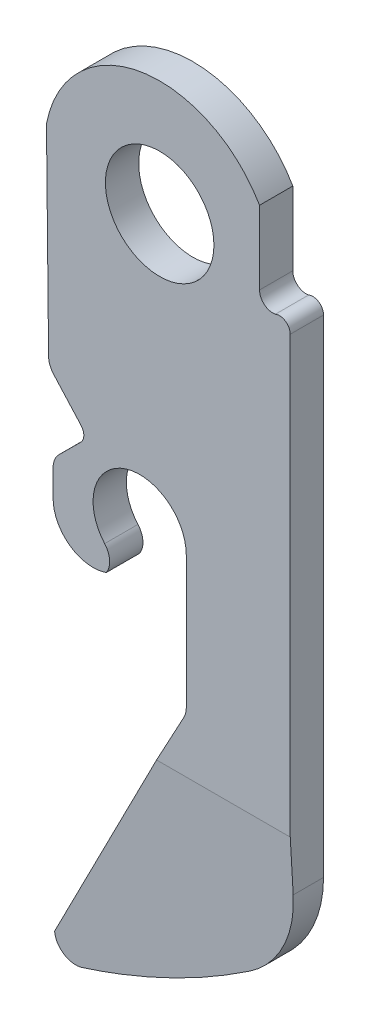
ISO-10303-21;
HEADER;
FILE_DESCRIPTION(('STEP AP214'),'2;1');
FILE_NAME('part.step','',(''),(''),'','','');
FILE_SCHEMA(('AUTOMOTIVE_DESIGN { 1 0 10303 214 1 1 1 1 }'));
ENDSEC;
DATA;
#1=APPLICATION_CONTEXT('core data for automotive mechanical design processes');
#2=APPLICATION_PROTOCOL_DEFINITION('international standard','automotive_design',2000,#1);
#3=PRODUCT_CONTEXT('',#1,'mechanical');
#4=PRODUCT('Part','Part','',(#3));
#5=PRODUCT_RELATED_PRODUCT_CATEGORY('part','',(#4));
#6=PRODUCT_DEFINITION_FORMATION('','',#4);
#7=PRODUCT_DEFINITION_CONTEXT('part definition',#1,'design');
#8=PRODUCT_DEFINITION('design','',#6,#7);
#9=PRODUCT_DEFINITION_SHAPE('','',#8);
#10=(LENGTH_UNIT() NAMED_UNIT(*) SI_UNIT(.MILLI.,.METRE.));
#11=(NAMED_UNIT(*) PLANE_ANGLE_UNIT() SI_UNIT($,.RADIAN.));
#12=(NAMED_UNIT(*) SI_UNIT($,.STERADIAN.) SOLID_ANGLE_UNIT());
#13=UNCERTAINTY_MEASURE_WITH_UNIT(LENGTH_MEASURE(1.E-05),#10,'distance_accuracy_value','');
#14=(GEOMETRIC_REPRESENTATION_CONTEXT(3) GLOBAL_UNCERTAINTY_ASSIGNED_CONTEXT((#13)) GLOBAL_UNIT_ASSIGNED_CONTEXT((#10,
#11,#12)) REPRESENTATION_CONTEXT('',''));
#15=CARTESIAN_POINT('',(0.,0.,0.));
#16=DIRECTION('',(0.,0.,1.));
#17=DIRECTION('',(1.,0.,0.));
#18=AXIS2_PLACEMENT_3D('',#15,#16,#17);
#19=CARTESIAN_POINT('',(69.8227395922592,59.177106462948,1.27));
#20=DIRECTION('',(0.,0.,-1.));
#21=DIRECTION('',(-1.,0.,0.));
#22=AXIS2_PLACEMENT_3D('',#19,#20,#21);
#23=CYLINDRICAL_SURFACE('',#22,0.40961460672115);
#24=CARTESIAN_POINT('',(69.8227395922592,59.177106462948,0.));
#25=DIRECTION('',(0.,0.,1.));
#26=DIRECTION('',(1.,0.,0.));
#27=AXIS2_PLACEMENT_3D('',#24,#25,#26);
#28=CIRCLE('',#27,0.40961460672115);
#29=CARTESIAN_POINT('',(70.2323541989803,59.177106462948,0.));
#30=VERTEX_POINT('',#29);
#31=CARTESIAN_POINT('',(69.6631439580081,59.5543508924195,0.));
#32=VERTEX_POINT('',#31);
#33=EDGE_CURVE('E417',#30,#32,#28,.T.);
#34=ORIENTED_EDGE('',*,*,#33,.T.);
#35=DIRECTION('',(0.,0.,-1.));
#36=VECTOR('',#35,1.);
#37=CARTESIAN_POINT('',(69.6631439580081,59.5543508924195,1.27));
#38=LINE('',#37,#36);
#39=CARTESIAN_POINT('',(69.6631439580081,59.5543508924195,1.27));
#40=VERTEX_POINT('',#39);
#41=EDGE_CURVE('E277',#40,#32,#38,.T.);
#42=ORIENTED_EDGE('',*,*,#41,.F.);
#43=CARTESIAN_POINT('',(69.8227395922592,59.177106462948,1.27));
#44=DIRECTION('',(0.,0.,1.));
#45=DIRECTION('',(1.,0.,0.));
#46=AXIS2_PLACEMENT_3D('',#43,#44,#45);
#47=CIRCLE('',#46,0.40961460672115);
#48=CARTESIAN_POINT('',(70.2323541989803,59.177106462948,1.27));
#49=VERTEX_POINT('',#48);
#50=EDGE_CURVE('E363',#49,#40,#47,.T.);
#51=ORIENTED_EDGE('',*,*,#50,.F.);
#52=DIRECTION('',(0.,0.,-1.));
#53=VECTOR('',#52,1.);
#54=CARTESIAN_POINT('',(70.2323541989803,59.177106462948,1.27));
#55=LINE('',#54,#53);
#56=EDGE_CURVE('E216',#49,#30,#55,.T.);
#57=ORIENTED_EDGE('',*,*,#56,.T.);
#58=EDGE_LOOP('',(#34,#42,#51,#57));
#59=FACE_BOUND('',#58,.T.);
#60=ADVANCED_FACE('F43',(#59),#23,.T.);
#61=CARTESIAN_POINT('',(69.5687395922592,60.0535019875076,1.27));
#62=DIRECTION('',(0.,0.,-1.));
#63=DIRECTION('',(-1.,0.,0.));
#64=AXIS2_PLACEMENT_3D('',#61,#62,#63);
#65=CYLINDRICAL_SURFACE('',#64,0.508000000000004);
#66=CARTESIAN_POINT('',(69.5687395922592,60.0535019875076,0.));
#67=DIRECTION('',(0.,0.,-1.));
#68=DIRECTION('',(1.,0.,0.));
#69=AXIS2_PLACEMENT_3D('',#66,#67,#68);
#70=CIRCLE('',#69,0.508000000000004);
#71=CARTESIAN_POINT('',(69.0607395922592,60.0535019875076,0.));
#72=VERTEX_POINT('',#71);
#73=EDGE_CURVE('E421',#32,#72,#70,.T.);
#74=ORIENTED_EDGE('',*,*,#73,.T.);
#75=DIRECTION('',(0.,0.,-1.));
#76=VECTOR('',#75,1.);
#77=CARTESIAN_POINT('',(69.0607395922592,60.0535019875076,1.27));
#78=LINE('',#77,#76);
#79=CARTESIAN_POINT('',(69.0607395922592,60.0535019875076,1.27));
#80=VERTEX_POINT('',#79);
#81=EDGE_CURVE('E273',#80,#72,#78,.T.);
#82=ORIENTED_EDGE('',*,*,#81,.F.);
#83=CARTESIAN_POINT('',(69.5687395922592,60.0535019875076,1.27));
#84=DIRECTION('',(0.,0.,-1.));
#85=DIRECTION('',(1.,0.,0.));
#86=AXIS2_PLACEMENT_3D('',#83,#84,#85);
#87=CIRCLE('',#86,0.508000000000004);
#88=EDGE_CURVE('E368',#40,#80,#87,.T.);
#89=ORIENTED_EDGE('',*,*,#88,.F.);
#90=ORIENTED_EDGE('',*,*,#41,.T.);
#91=EDGE_LOOP('',(#74,#82,#89,#90));
#92=FACE_BOUND('',#91,.T.);
#93=ADVANCED_FACE('F509',(#92),#65,.F.);
#94=CARTESIAN_POINT('',(69.0607395922592,62.852369819455,1.27));
#95=DIRECTION('',(-1.,0.,0.));
#96=DIRECTION('',(0.,0.,1.));
#97=AXIS2_PLACEMENT_3D('',#94,#95,#96);
#98=PLANE('',#97);
#99=DIRECTION('',(0.,1.,0.));
#100=VECTOR('',#99,1.);
#101=CARTESIAN_POINT('',(69.0607395922592,62.852369819455,0.));
#102=LINE('',#101,#100);
#103=CARTESIAN_POINT('',(69.0607395922592,62.852369819455,0.));
#104=VERTEX_POINT('',#103);
#105=EDGE_CURVE('E425',#72,#104,#102,.T.);
#106=ORIENTED_EDGE('',*,*,#105,.T.);
#107=DIRECTION('',(0.,0.,-1.));
#108=VECTOR('',#107,1.);
#109=CARTESIAN_POINT('',(69.0607395922592,62.852369819455,1.27));
#110=LINE('',#109,#108);
#111=CARTESIAN_POINT('',(69.0607395922592,62.852369819455,1.27));
#112=VERTEX_POINT('',#111);
#113=EDGE_CURVE('E269',#112,#104,#110,.T.);
#114=ORIENTED_EDGE('',*,*,#113,.F.);
#115=DIRECTION('',(0.,1.,0.));
#116=VECTOR('',#115,1.);
#117=CARTESIAN_POINT('',(69.0607395922592,62.852369819455,1.27));
#118=LINE('',#117,#116);
#119=EDGE_CURVE('E375',#80,#112,#118,.T.);
#120=ORIENTED_EDGE('',*,*,#119,.F.);
#121=ORIENTED_EDGE('',*,*,#81,.T.);
#122=EDGE_LOOP('',(#106,#114,#120,#121));
#123=FACE_BOUND('',#122,.T.);
#124=ADVANCED_FACE('F505',(#123),#98,.F.);
#125=CARTESIAN_POINT('',(65.2507395922592,60.6631019875076,1.27));
#126=DIRECTION('',(0.,0.,-1.));
#127=DIRECTION('',(-1.,0.,0.));
#128=AXIS2_PLACEMENT_3D('',#125,#126,#127);
#129=CYLINDRICAL_SURFACE('',#128,4.39420000000001);
#130=CARTESIAN_POINT('',(65.2507395922592,60.6631019875076,0.));
#131=DIRECTION('',(0.,0.,1.));
#132=DIRECTION('',(1.,0.,0.));
#133=AXIS2_PLACEMENT_3D('',#130,#131,#132);
#134=CIRCLE('',#133,4.39420000000001);
#135=CARTESIAN_POINT('',(60.9327395922592,61.4778839460707,0.));
#136=VERTEX_POINT('',#135);
#137=EDGE_CURVE('E428',#104,#136,#134,.T.);
#138=ORIENTED_EDGE('',*,*,#137,.T.);
#139=DIRECTION('',(0.,0.,-1.));
#140=VECTOR('',#139,1.);
#141=CARTESIAN_POINT('',(60.9327395922592,61.4778839460707,1.27));
#142=LINE('',#141,#140);
#143=CARTESIAN_POINT('',(60.9327395922592,61.4778839460707,1.27));
#144=VERTEX_POINT('',#143);
#145=EDGE_CURVE('E265',#144,#136,#142,.T.);
#146=ORIENTED_EDGE('',*,*,#145,.F.);
#147=CARTESIAN_POINT('',(65.2507395922592,60.6631019875076,1.27));
#148=DIRECTION('',(0.,0.,1.));
#149=DIRECTION('',(1.,0.,0.));
#150=AXIS2_PLACEMENT_3D('',#147,#148,#149);
#151=CIRCLE('',#150,4.39420000000001);
#152=EDGE_CURVE('E383',#112,#144,#151,.T.);
#153=ORIENTED_EDGE('',*,*,#152,.F.);
#154=ORIENTED_EDGE('',*,*,#113,.T.);
#155=EDGE_LOOP('',(#138,#146,#153,#154));
#156=FACE_BOUND('',#155,.T.);
#157=ADVANCED_FACE('F500',(#156),#129,.T.);
#158=CARTESIAN_POINT('',(60.9327395922592,61.4778839460707,1.27));
#159=DIRECTION('',(0.999943543390208,0.0106259132423668,0.));
#160=DIRECTION('',(-0.0106259132423668,0.999943543390208,0.));
#161=AXIS2_PLACEMENT_3D('',#158,#159,#160);
#162=PLANE('',#161);
#163=DIRECTION('',(0.0106259132423668,-0.999943543390209,0.));
#164=VECTOR('',#163,1.);
#165=CARTESIAN_POINT('',(60.9327395922592,61.4778839460707,0.));
#166=LINE('',#165,#164);
#167=CARTESIAN_POINT('',(61.0139214823224,53.8383234718461,0.));
#168=VERTEX_POINT('',#167);
#169=EDGE_CURVE('E431',#136,#168,#166,.T.);
#170=ORIENTED_EDGE('',*,*,#169,.T.);
#171=DIRECTION('',(0.,0.,-1.));
#172=VECTOR('',#171,1.);
#173=CARTESIAN_POINT('',(61.0139214823224,53.8383234718461,1.27));
#174=LINE('',#173,#172);
#175=CARTESIAN_POINT('',(61.0139214823224,53.8383234718461,1.27));
#176=VERTEX_POINT('',#175);
#177=EDGE_CURVE('E66',#168,#176,#174,.F.);
#178=ORIENTED_EDGE('',*,*,#177,.T.);
#179=DIRECTION('',(0.0106259132423668,-0.999943543390209,0.));
#180=VECTOR('',#179,1.);
#181=CARTESIAN_POINT('',(60.9327395922592,61.4778839460707,1.27));
#182=LINE('',#181,#180);
#183=EDGE_CURVE('E386',#144,#176,#182,.T.);
#184=ORIENTED_EDGE('',*,*,#183,.F.);
#185=ORIENTED_EDGE('',*,*,#145,.T.);
#186=EDGE_LOOP('',(#170,#178,#184,#185));
#187=FACE_BOUND('',#186,.T.);
#188=ADVANCED_FACE('F496',(#187),#162,.F.);
#189=CARTESIAN_POINT('',(61.0169736452111,53.5511019875076,1.27));
#190=DIRECTION('',(0.744114089191891,0.668052559508698,0.));
#191=DIRECTION('',(-0.668052559508698,0.744114089191891,0.));
#192=AXIS2_PLACEMENT_3D('',#189,#190,#191);
#193=PLANE('',#192);
#194=DIRECTION('',(0.668052559508698,-0.744114089191891,0.));
#195=VECTOR('',#194,1.);
#196=CARTESIAN_POINT('',(61.0169736452111,53.5511019875076,1.27));
#197=LINE('',#196,#195);
#198=CARTESIAN_POINT('',(61.2088635264215,53.3373643673912,1.27));
#199=VERTEX_POINT('',#198);
#200=CARTESIAN_POINT('',(62.2535395922592,52.1737460739398,1.27));
#201=VERTEX_POINT('',#200);
#202=EDGE_CURVE('E389',#199,#201,#197,.T.);
#203=ORIENTED_EDGE('',*,*,#202,.F.);
#204=DIRECTION('',(0.,0.,-1.));
#205=VECTOR('',#204,1.);
#206=CARTESIAN_POINT('',(61.2088635264215,53.3373643673912,1.27));
#207=LINE('',#206,#205);
#208=CARTESIAN_POINT('',(61.2088635264215,53.3373643673912,0.));
#209=VERTEX_POINT('',#208);
#210=EDGE_CURVE('E288',#199,#209,#207,.T.);
#211=ORIENTED_EDGE('',*,*,#210,.T.);
#212=DIRECTION('',(0.668052559508698,-0.744114089191891,0.));
#213=VECTOR('',#212,1.);
#214=CARTESIAN_POINT('',(61.0169736452111,53.5511019875076,0.));
#215=LINE('',#214,#213);
#216=CARTESIAN_POINT('',(62.2535395922592,52.1737460739398,0.));
#217=VERTEX_POINT('',#216);
#218=EDGE_CURVE('E434',#209,#217,#215,.T.);
#219=ORIENTED_EDGE('',*,*,#218,.T.);
#220=DIRECTION('',(0.,0.,-1.));
#221=VECTOR('',#220,1.);
#222=CARTESIAN_POINT('',(62.2535395922592,52.1737460739398,1.27));
#223=LINE('',#222,#221);
#224=EDGE_CURVE('E261',#201,#217,#223,.T.);
#225=ORIENTED_EDGE('',*,*,#224,.F.);
#226=EDGE_LOOP('',(#203,#211,#219,#225));
#227=FACE_BOUND('',#226,.T.);
#228=ADVANCED_FACE('F490',(#227),#193,.F.);
#229=CARTESIAN_POINT('',(61.9487395922592,51.9001019875076,1.27));
#230=DIRECTION('',(0.,0.,-1.));
#231=DIRECTION('',(-1.,0.,0.));
#232=AXIS2_PLACEMENT_3D('',#229,#230,#231);
#233=CYLINDRICAL_SURFACE('',#232,0.409614606721149);
#234=CARTESIAN_POINT('',(61.9487395922592,51.9001019875076,0.));
#235=DIRECTION('',(0.,0.,-1.));
#236=DIRECTION('',(1.,0.,0.));
#237=AXIS2_PLACEMENT_3D('',#234,#235,#236);
#238=CIRCLE('',#237,0.409614606721149);
#239=CARTESIAN_POINT('',(62.2373397423607,51.6094233343514,0.));
#240=VERTEX_POINT('',#239);
#241=EDGE_CURVE('E437',#217,#240,#238,.T.);
#242=ORIENTED_EDGE('',*,*,#241,.T.);
#243=DIRECTION('',(0.,0.,-1.));
#244=VECTOR('',#243,1.);
#245=CARTESIAN_POINT('',(62.2373397423607,51.6094233343514,1.27));
#246=LINE('',#245,#244);
#247=CARTESIAN_POINT('',(62.2373397423607,51.6094233343514,1.27));
#248=VERTEX_POINT('',#247);
#249=EDGE_CURVE('E257',#248,#240,#246,.T.);
#250=ORIENTED_EDGE('',*,*,#249,.F.);
#251=CARTESIAN_POINT('',(61.9487395922592,51.9001019875076,1.27));
#252=DIRECTION('',(0.,0.,-1.));
#253=DIRECTION('',(1.,0.,0.));
#254=AXIS2_PLACEMENT_3D('',#251,#252,#253);
#255=CIRCLE('',#254,0.409614606721149);
#256=EDGE_CURVE('E392',#201,#248,#255,.T.);
#257=ORIENTED_EDGE('',*,*,#256,.F.);
#258=ORIENTED_EDGE('',*,*,#224,.T.);
#259=EDGE_LOOP('',(#242,#250,#257,#258));
#260=FACE_BOUND('',#259,.T.);
#261=ADVANCED_FACE('F485',(#260),#233,.F.);
#262=CARTESIAN_POINT('',(62.2373397423607,51.6094233343514,1.27));
#263=DIRECTION('',(0.704565084755411,-0.709639374149716,0.));
#264=DIRECTION('',(0.709639374149716,0.704565084755411,0.));
#265=AXIS2_PLACEMENT_3D('',#262,#263,#264);
#266=PLANE('',#265);
#267=DIRECTION('',(-0.709639374149716,-0.704565084755411,0.));
#268=VECTOR('',#267,1.);
#269=CARTESIAN_POINT('',(62.2373397423607,51.6094233343514,0.));
#270=LINE('',#269,#268);
#271=CARTESIAN_POINT('',(61.4118609976755,50.7898471906097,0.));
#272=VERTEX_POINT('',#271);
#273=EDGE_CURVE('E440',#240,#272,#270,.T.);
#274=ORIENTED_EDGE('',*,*,#273,.T.);
#275=DIRECTION('',(0.,0.,-1.));
#276=VECTOR('',#275,1.);
#277=CARTESIAN_POINT('',(61.4118609976755,50.7898471906097,1.27));
#278=LINE('',#277,#276);
#279=CARTESIAN_POINT('',(61.4118609976755,50.7898471906097,1.27));
#280=VERTEX_POINT('',#279);
#281=EDGE_CURVE('E253',#280,#272,#278,.T.);
#282=ORIENTED_EDGE('',*,*,#281,.F.);
#283=DIRECTION('',(-0.709639374149716,-0.704565084755411,0.));
#284=VECTOR('',#283,1.);
#285=CARTESIAN_POINT('',(62.2373397423607,51.6094233343514,1.27));
#286=LINE('',#285,#284);
#287=EDGE_CURVE('E395',#248,#280,#286,.T.);
#288=ORIENTED_EDGE('',*,*,#287,.F.);
#289=ORIENTED_EDGE('',*,*,#249,.T.);
#290=EDGE_LOOP('',(#274,#282,#288,#289));
#291=FACE_BOUND('',#290,.T.);
#292=ADVANCED_FACE('F481',(#291),#266,.F.);
#293=CARTESIAN_POINT('',(61.9487395922592,50.2491019875076,1.27));
#294=DIRECTION('',(0.,0.,-1.));
#295=DIRECTION('',(-1.,0.,0.));
#296=AXIS2_PLACEMENT_3D('',#293,#294,#295);
#297=CYLINDRICAL_SURFACE('',#296,0.761999999999995);
#298=CARTESIAN_POINT('',(61.9487395922592,50.2491019875076,0.));
#299=DIRECTION('',(0.,0.,1.));
#300=DIRECTION('',(1.,0.,0.));
#301=AXIS2_PLACEMENT_3D('',#298,#299,#300);
#302=CIRCLE('',#301,0.761999999999995);
#303=CARTESIAN_POINT('',(61.1867395922592,50.2491019875076,0.));
#304=VERTEX_POINT('',#303);
#305=EDGE_CURVE('E443',#272,#304,#302,.T.);
#306=ORIENTED_EDGE('',*,*,#305,.T.);
#307=DIRECTION('',(0.,0.,-1.));
#308=VECTOR('',#307,1.);
#309=CARTESIAN_POINT('',(61.1867395922592,50.2491019875076,1.27));
#310=LINE('',#309,#308);
#311=CARTESIAN_POINT('',(61.1867395922592,50.2491019875076,1.27));
#312=VERTEX_POINT('',#311);
#313=EDGE_CURVE('E249',#312,#304,#310,.T.);
#314=ORIENTED_EDGE('',*,*,#313,.F.);
#315=CARTESIAN_POINT('',(61.9487395922592,50.2491019875076,1.27));
#316=DIRECTION('',(0.,0.,1.));
#317=DIRECTION('',(1.,0.,0.));
#318=AXIS2_PLACEMENT_3D('',#315,#316,#317);
#319=CIRCLE('',#318,0.761999999999995);
#320=EDGE_CURVE('E398',#280,#312,#319,.T.);
#321=ORIENTED_EDGE('',*,*,#320,.F.);
#322=ORIENTED_EDGE('',*,*,#281,.T.);
#323=EDGE_LOOP('',(#306,#314,#321,#322));
#324=FACE_BOUND('',#323,.T.);
#325=ADVANCED_FACE('F477',(#324),#297,.T.);
#326=CARTESIAN_POINT('',(61.1867395922592,50.2491019875076,1.27));
#327=DIRECTION('',(1.,0.,0.));
#328=DIRECTION('',(0.,0.,-1.));
#329=AXIS2_PLACEMENT_3D('',#326,#327,#328);
#330=PLANE('',#329);
#331=DIRECTION('',(0.,-1.,0.));
#332=VECTOR('',#331,1.);
#333=CARTESIAN_POINT('',(61.1867395922592,50.2491019875076,0.));
#334=LINE('',#333,#332);
#335=CARTESIAN_POINT('',(61.1867395922592,49.2331019875076,0.));
#336=VERTEX_POINT('',#335);
#337=EDGE_CURVE('E446',#304,#336,#334,.T.);
#338=ORIENTED_EDGE('',*,*,#337,.T.);
#339=DIRECTION('',(0.,0.,-1.));
#340=VECTOR('',#339,1.);
#341=CARTESIAN_POINT('',(61.1867395922592,49.2331019875076,1.27));
#342=LINE('',#341,#340);
#343=CARTESIAN_POINT('',(61.1867395922592,49.2331019875076,1.27));
#344=VERTEX_POINT('',#343);
#345=EDGE_CURVE('E245',#344,#336,#342,.T.);
#346=ORIENTED_EDGE('',*,*,#345,.F.);
#347=DIRECTION('',(0.,-1.,0.));
#348=VECTOR('',#347,1.);
#349=CARTESIAN_POINT('',(61.1867395922592,50.2491019875076,1.27));
#350=LINE('',#349,#348);
#351=EDGE_CURVE('E401',#312,#344,#350,.T.);
#352=ORIENTED_EDGE('',*,*,#351,.F.);
#353=ORIENTED_EDGE('',*,*,#313,.T.);
#354=EDGE_LOOP('',(#338,#346,#352,#353));
#355=FACE_BOUND('',#354,.T.);
#356=ADVANCED_FACE('F473',(#355),#330,.F.);
#357=CARTESIAN_POINT('',(62.7107395922592,49.2331019875076,1.27));
#358=DIRECTION('',(0.,0.,-1.));
#359=DIRECTION('',(-1.,0.,0.));
#360=AXIS2_PLACEMENT_3D('',#357,#358,#359);
#361=CYLINDRICAL_SURFACE('',#360,1.524);
#362=CARTESIAN_POINT('',(62.7107395922592,49.2331019875076,0.));
#363=DIRECTION('',(0.,0.,1.));
#364=DIRECTION('',(1.,0.,0.));
#365=AXIS2_PLACEMENT_3D('',#362,#363,#364);
#366=CIRCLE('',#365,1.524);
#367=CARTESIAN_POINT('',(63.2148646711787,47.7948968891977,0.));
#368=VERTEX_POINT('',#367);
#369=EDGE_CURVE('E449',#336,#368,#366,.T.);
#370=ORIENTED_EDGE('',*,*,#369,.T.);
#371=DIRECTION('',(0.,0.,-1.));
#372=VECTOR('',#371,1.);
#373=CARTESIAN_POINT('',(63.2148646711787,47.7948968891977,1.27));
#374=LINE('',#373,#372);
#375=CARTESIAN_POINT('',(63.2148646711787,47.7948968891977,1.27));
#376=VERTEX_POINT('',#375);
#377=EDGE_CURVE('E241',#376,#368,#374,.T.);
#378=ORIENTED_EDGE('',*,*,#377,.F.);
#379=CARTESIAN_POINT('',(62.7107395922592,49.2331019875076,1.27));
#380=DIRECTION('',(0.,0.,1.));
#381=DIRECTION('',(1.,0.,0.));
#382=AXIS2_PLACEMENT_3D('',#379,#380,#381);
#383=CIRCLE('',#382,1.524);
#384=EDGE_CURVE('E404',#344,#376,#383,.T.);
#385=ORIENTED_EDGE('',*,*,#384,.F.);
#386=ORIENTED_EDGE('',*,*,#345,.T.);
#387=EDGE_LOOP('',(#370,#378,#385,#386));
#388=FACE_BOUND('',#387,.T.);
#389=ADVANCED_FACE('F468',(#388),#361,.T.);
#390=CARTESIAN_POINT('',(62.5805249712062,48.2171019875076,1.27));
#391=DIRECTION('',(0.,0.,-1.));
#392=DIRECTION('',(-1.,0.,0.));
#393=AXIS2_PLACEMENT_3D('',#390,#391,#392);
#394=CYLINDRICAL_SURFACE('',#393,0.761999999999994);
#395=CARTESIAN_POINT('',(62.5805249712062,48.2171019875076,0.));
#396=DIRECTION('',(0.,0.,1.));
#397=DIRECTION('',(1.,0.,0.));
#398=AXIS2_PLACEMENT_3D('',#395,#396,#397);
#399=CIRCLE('',#398,0.761999999999994);
#400=CARTESIAN_POINT('',(63.152989357522,48.7200219875075,0.));
#401=VERTEX_POINT('',#400);
#402=EDGE_CURVE('E349',#368,#401,#399,.T.);
#403=ORIENTED_EDGE('',*,*,#402,.T.);
#404=DIRECTION('',(0.,0.,-1.));
#405=VECTOR('',#404,1.);
#406=CARTESIAN_POINT('',(63.152989357522,48.7200219875075,1.27));
#407=LINE('',#406,#405);
#408=CARTESIAN_POINT('',(63.152989357522,48.7200219875075,1.27));
#409=VERTEX_POINT('',#408);
#410=EDGE_CURVE('E237',#409,#401,#407,.T.);
#411=ORIENTED_EDGE('',*,*,#410,.F.);
#412=CARTESIAN_POINT('',(62.5805249712062,48.2171019875076,1.27));
#413=DIRECTION('',(0.,0.,1.));
#414=DIRECTION('',(1.,0.,0.));
#415=AXIS2_PLACEMENT_3D('',#412,#413,#414);
#416=CIRCLE('',#415,0.761999999999994);
#417=EDGE_CURVE('E407',#376,#409,#416,.T.);
#418=ORIENTED_EDGE('',*,*,#417,.F.);
#419=ORIENTED_EDGE('',*,*,#377,.T.);
#420=EDGE_LOOP('',(#403,#411,#418,#419));
#421=FACE_BOUND('',#420,.T.);
#422=ADVANCED_FACE('F457',(#421),#394,.T.);
#423=CARTESIAN_POINT('',(64.4887395922591,49.8935019875076,1.27));
#424=DIRECTION('',(0.,0.,-1.));
#425=DIRECTION('',(-1.,0.,0.));
#426=AXIS2_PLACEMENT_3D('',#423,#424,#425);
#427=CYLINDRICAL_SURFACE('',#426,1.77800000000005);
#428=CARTESIAN_POINT('',(64.4887395922591,49.8935019875076,0.));
#429=DIRECTION('',(0.,0.,-1.));
#430=DIRECTION('',(1.,0.,0.));
#431=AXIS2_PLACEMENT_3D('',#428,#429,#430);
#432=CIRCLE('',#431,1.77800000000005);
#433=CARTESIAN_POINT('',(66.2667395922592,49.8935019875076,0.));
#434=VERTEX_POINT('',#433);
#435=EDGE_CURVE('E341',#401,#434,#432,.T.);
#436=ORIENTED_EDGE('',*,*,#435,.T.);
#437=DIRECTION('',(0.,0.,-1.));
#438=VECTOR('',#437,1.);
#439=CARTESIAN_POINT('',(66.2667395922592,49.8935019875076,1.27));
#440=LINE('',#439,#438);
#441=CARTESIAN_POINT('',(66.2667395922592,49.8935019875076,1.27));
#442=VERTEX_POINT('',#441);
#443=EDGE_CURVE('E233',#442,#434,#440,.T.);
#444=ORIENTED_EDGE('',*,*,#443,.F.);
#445=CARTESIAN_POINT('',(64.4887395922591,49.8935019875076,1.27));
#446=DIRECTION('',(0.,0.,-1.));
#447=DIRECTION('',(1.,0.,0.));
#448=AXIS2_PLACEMENT_3D('',#445,#446,#447);
#449=CIRCLE('',#448,1.77800000000005);
#450=EDGE_CURVE('E410',#409,#442,#449,.T.);
#451=ORIENTED_EDGE('',*,*,#450,.F.);
#452=ORIENTED_EDGE('',*,*,#410,.T.);
#453=EDGE_LOOP('',(#436,#444,#451,#452));
#454=FACE_BOUND('',#453,.T.);
#455=ADVANCED_FACE('F463',(#454),#427,.F.);
#456=CARTESIAN_POINT('',(66.2667395922591,44.6977003861654,1.27));
#457=DIRECTION('',(1.,3.79191120834418E-13,0.));
#458=DIRECTION('',(-3.79191120834418E-13,1.,0.));
#459=AXIS2_PLACEMENT_3D('',#456,#457,#458);
#460=PLANE('',#459);
#461=DIRECTION('',(3.79191120834418E-13,-1.,0.));
#462=VECTOR('',#461,1.);
#463=CARTESIAN_POINT('',(66.2667395922591,44.6977003861654,0.));
#464=LINE('',#463,#462);
#465=CARTESIAN_POINT('',(66.2667395922591,44.8536986327853,0.));
#466=VERTEX_POINT('',#465);
#467=EDGE_CURVE('E333',#434,#466,#464,.T.);
#468=ORIENTED_EDGE('',*,*,#467,.T.);
#469=DIRECTION('',(0.,0.,-1.));
#470=VECTOR('',#469,1.);
#471=CARTESIAN_POINT('',(66.2667395922591,44.8536986327853,1.27));
#472=LINE('',#471,#470);
#473=CARTESIAN_POINT('',(66.2667395922591,44.8536986327853,1.27));
#474=VERTEX_POINT('',#473);
#475=EDGE_CURVE('E285',#466,#474,#472,.F.);
#476=ORIENTED_EDGE('',*,*,#475,.T.);
#477=DIRECTION('',(0.,-1.,0.));
#478=VECTOR('',#477,1.);
#479=CARTESIAN_POINT('',(66.2667395922592,49.8935019875076,1.27));
#480=LINE('',#479,#478);
#481=EDGE_CURVE('E314',#442,#474,#480,.T.);
#482=ORIENTED_EDGE('',*,*,#481,.F.);
#483=ORIENTED_EDGE('',*,*,#443,.T.);
#484=EDGE_LOOP('',(#468,#476,#482,#483));
#485=FACE_BOUND('',#484,.T.);
#486=ADVANCED_FACE('F338',(#485),#460,.F.);
#487=CARTESIAN_POINT('',(66.2667395922592,44.6611019875076,1.27));
#488=DIRECTION('',(0.879905397657193,-0.475148914734883,0.));
#489=DIRECTION('',(0.475148914734883,0.879905397657193,0.));
#490=AXIS2_PLACEMENT_3D('',#487,#488,#489);
#491=PLANE('',#490);
#492=DIRECTION('',(0.,0.,-1.));
#493=VECTOR('',#492,1.);
#494=CARTESIAN_POINT('',(60.7803395922592,34.5011019875076,1.27));
#495=LINE('',#494,#493);
#496=CARTESIAN_POINT('',(60.7803395922592,34.5011019875076,0.805864394760537));
#497=VERTEX_POINT('',#496);
#498=CARTESIAN_POINT('',(60.7803395922592,34.5011019875076,0.));
#499=VERTEX_POINT('',#498);
#500=EDGE_CURVE('E230',#497,#499,#495,.T.);
#501=ORIENTED_EDGE('',*,*,#500,.F.);
#502=DIRECTION('',(0.474540567740976,0.878778829149957,0.0505867473346936));
#503=VECTOR('',#502,1.);
#504=CARTESIAN_POINT('',(66.2638415808552,44.6557352997225,1.39041405913783));
#505=LINE('',#504,#503);
#506=CARTESIAN_POINT('',(65.1342699242867,42.5639359357067,1.27));
#507=VERTEX_POINT('',#506);
#508=EDGE_CURVE('E324',#497,#507,#505,.T.);
#509=ORIENTED_EDGE('',*,*,#508,.T.);
#510=DIRECTION('',(-0.475148914734884,-0.879905397657193,0.));
#511=VECTOR('',#510,1.);
#512=CARTESIAN_POINT('',(66.2667395922592,44.6611019875076,1.27));
#513=LINE('',#512,#511);
#514=CARTESIAN_POINT('',(66.1752275052739,44.491635159757,1.27));
#515=VERTEX_POINT('',#514);
#516=EDGE_CURVE('E312',#515,#507,#513,.T.);
#517=ORIENTED_EDGE('',*,*,#516,.F.);
#518=DIRECTION('',(0.,0.,-1.));
#519=VECTOR('',#518,1.);
#520=CARTESIAN_POINT('',(66.1752275052739,44.491635159757,0.));
#521=LINE('',#520,#519);
#522=CARTESIAN_POINT('',(66.1752275052739,44.491635159757,0.));
#523=VERTEX_POINT('',#522);
#524=EDGE_CURVE('E281',#515,#523,#521,.T.);
#525=ORIENTED_EDGE('',*,*,#524,.T.);
#526=DIRECTION('',(-0.475148914734884,-0.879905397657193,0.));
#527=VECTOR('',#526,1.);
#528=CARTESIAN_POINT('',(66.2667395922592,44.6611019875076,0.));
#529=LINE('',#528,#527);
#530=EDGE_CURVE('E336',#523,#499,#529,.T.);
#531=ORIENTED_EDGE('',*,*,#530,.T.);
#532=EDGE_LOOP('',(#501,#509,#517,#525,#531));
#533=FACE_BOUND('',#532,.T.);
#534=ADVANCED_FACE('F321',(#533),#491,.F.);
#535=CARTESIAN_POINT('',(61.5423395922592,34.5011019875076,1.27));
#536=DIRECTION('',(0.,0.,-1.));
#537=DIRECTION('',(-1.,0.,0.));
#538=AXIS2_PLACEMENT_3D('',#535,#536,#537);
#539=CYLINDRICAL_SURFACE('',#538,0.761999999999998);
#540=DIRECTION('',(0.,0.,-1.));
#541=VECTOR('',#540,1.);
#542=CARTESIAN_POINT('',(61.7816075922592,33.7776416747218,1.27));
#543=LINE('',#542,#541);
#544=CARTESIAN_POINT('',(61.7816075922592,33.7776416747218,0.764218530254482));
#545=VERTEX_POINT('',#544);
#546=CARTESIAN_POINT('',(61.7816075922592,33.7776416747218,0.));
#547=VERTEX_POINT('',#546);
#548=EDGE_CURVE('E222',#545,#547,#543,.T.);
#549=ORIENTED_EDGE('',*,*,#548,.F.);
#550=CARTESIAN_POINT('',(61.5423395922592,34.5011019875076,0.805864394760537));
#551=DIRECTION('',(0.,0.0574696823760118,-0.998347252015851));
#552=DIRECTION('',(0.,-0.998347252015851,-0.0574696823760118));
#553=AXIS2_PLACEMENT_3D('',#550,#551,#552);
#554=ELLIPSE('',#553,0.76326147887058,0.761999999999998);
#555=EDGE_CURVE('E518',#545,#497,#554,.T.);
#556=ORIENTED_EDGE('',*,*,#555,.T.);
#557=ORIENTED_EDGE('',*,*,#500,.T.);
#558=CARTESIAN_POINT('',(61.5423395922592,34.5011019875076,0.));
#559=DIRECTION('',(0.,0.,1.));
#560=DIRECTION('',(1.,0.,0.));
#561=AXIS2_PLACEMENT_3D('',#558,#559,#560);
#562=CIRCLE('',#561,0.761999999999998);
#563=EDGE_CURVE('E347',#499,#547,#562,.T.);
#564=ORIENTED_EDGE('',*,*,#563,.T.);
#565=EDGE_LOOP('',(#549,#556,#557,#564));
#566=FACE_BOUND('',#565,.T.);
#567=ADVANCED_FACE('F517',(#566),#539,.T.);
#568=CARTESIAN_POINT('',(53.5667395922592,58.6164457470313,1.27));
#569=DIRECTION('',(0.,0.,-1.));
#570=DIRECTION('',(-1.,0.,0.));
#571=AXIS2_PLACEMENT_3D('',#568,#569,#570);
#572=CYLINDRICAL_SURFACE('',#571,26.162);
#573=DIRECTION('',(0.,0.,-1.));
#574=VECTOR('',#573,1.);
#575=CARTESIAN_POINT('',(68.3551617375182,37.0351386862064,1.27));
#576=LINE('',#575,#574);
#577=CARTESIAN_POINT('',(68.3551617375182,37.0351386862064,0.95173576758129));
#578=VERTEX_POINT('',#577);
#579=CARTESIAN_POINT('',(68.3551617375182,37.0351386862064,0.));
#580=VERTEX_POINT('',#579);
#581=EDGE_CURVE('E215',#578,#580,#576,.T.);
#582=ORIENTED_EDGE('',*,*,#581,.F.);
#583=CARTESIAN_POINT('',(53.5667395922592,58.6164457470313,2.19405987829572));
#584=DIRECTION('',(0.,0.0574696823760118,-0.998347252015851));
#585=DIRECTION('',(0.,-0.998347252015851,-0.0574696823760118));
#586=AXIS2_PLACEMENT_3D('',#583,#584,#585);
#587=ELLIPSE('',#586,26.2053107745567,26.162);
#588=EDGE_CURVE('E195',#578,#545,#587,.T.);
#589=ORIENTED_EDGE('',*,*,#588,.T.);
#590=ORIENTED_EDGE('',*,*,#548,.T.);
#591=CARTESIAN_POINT('',(53.5667395922592,58.6164457470313,0.));
#592=DIRECTION('',(0.,0.,1.));
#593=DIRECTION('',(1.,0.,0.));
#594=AXIS2_PLACEMENT_3D('',#591,#592,#593);
#595=CIRCLE('',#594,26.162);
#596=EDGE_CURVE('E356',#547,#580,#595,.T.);
#597=ORIENTED_EDGE('',*,*,#596,.T.);
#598=EDGE_LOOP('',(#582,#589,#590,#597));
#599=FACE_BOUND('',#598,.T.);
#600=ADVANCED_FACE('F513',(#599),#572,.T.);
#601=CARTESIAN_POINT('',(65.9143541989803,40.5971019875075,1.27));
#602=DIRECTION('',(0.,0.,-1.));
#603=DIRECTION('',(-1.,0.,0.));
#604=AXIS2_PLACEMENT_3D('',#601,#602,#603);
#605=CYLINDRICAL_SURFACE('',#604,4.31799999999997);
#606=DIRECTION('',(0.,0.,-1.));
#607=VECTOR('',#606,1.);
#608=CARTESIAN_POINT('',(70.2323541989803,40.5971019875075,1.27));
#609=LINE('',#608,#607);
#610=CARTESIAN_POINT('',(70.2323541989803,40.5971019875075,1.15677955284484));
#611=VERTEX_POINT('',#610);
#612=CARTESIAN_POINT('',(70.2323541989803,40.5971019875075,0.));
#613=VERTEX_POINT('',#612);
#614=EDGE_CURVE('E204',#611,#613,#609,.T.);
#615=ORIENTED_EDGE('',*,*,#614,.F.);
#616=CARTESIAN_POINT('',(65.9143541989803,40.5971019875075,1.15677955284484));
#617=DIRECTION('',(0.,0.0574696823760118,-0.998347252015851));
#618=DIRECTION('',(0.,-0.998347252015851,-0.0574696823760118));
#619=AXIS2_PLACEMENT_3D('',#616,#617,#618);
#620=ELLIPSE('',#619,4.3251483802666,4.31799999999997);
#621=EDGE_CURVE('E192',#611,#578,#620,.T.);
#622=ORIENTED_EDGE('',*,*,#621,.T.);
#623=ORIENTED_EDGE('',*,*,#581,.T.);
#624=CARTESIAN_POINT('',(65.9143541989803,40.5971019875075,0.));
#625=DIRECTION('',(0.,0.,1.));
#626=DIRECTION('',(1.,0.,0.));
#627=AXIS2_PLACEMENT_3D('',#624,#625,#626);
#628=CIRCLE('',#627,4.31799999999997);
#629=EDGE_CURVE('E212',#580,#613,#628,.T.);
#630=ORIENTED_EDGE('',*,*,#629,.T.);
#631=EDGE_LOOP('',(#615,#622,#623,#630));
#632=FACE_BOUND('',#631,.T.);
#633=ADVANCED_FACE('F210',(#632),#605,.T.);
#634=CARTESIAN_POINT('',(70.2323541989803,59.177106462948,1.27));
#635=DIRECTION('',(-1.,0.,0.));
#636=DIRECTION('',(0.,-1.,0.));
#637=AXIS2_PLACEMENT_3D('',#634,#635,#636);
#638=PLANE('',#637);
#639=DIRECTION('',(0.,1.,0.));
#640=VECTOR('',#639,1.);
#641=CARTESIAN_POINT('',(70.2323541989803,59.177106462948,1.27));
#642=LINE('',#641,#640);
#643=CARTESIAN_POINT('',(70.2323541989803,42.5639359357067,1.27));
#644=VERTEX_POINT('',#643);
#645=EDGE_CURVE('E207',#644,#49,#642,.T.);
#646=ORIENTED_EDGE('',*,*,#645,.F.);
#647=DIRECTION('',(0.,0.998347252015851,0.0574696823760118));
#648=VECTOR('',#647,1.);
#649=CARTESIAN_POINT('',(70.2323541989803,33.7391019875076,0.762));
#650=LINE('',#649,#648);
#651=EDGE_CURVE('E58',#611,#644,#650,.T.);
#652=ORIENTED_EDGE('',*,*,#651,.F.);
#653=ORIENTED_EDGE('',*,*,#614,.T.);
#654=DIRECTION('',(0.,1.,0.));
#655=VECTOR('',#654,1.);
#656=CARTESIAN_POINT('',(70.2323541989803,59.177106462948,0.));
#657=LINE('',#656,#655);
#658=EDGE_CURVE('E361',#613,#30,#657,.T.);
#659=ORIENTED_EDGE('',*,*,#658,.T.);
#660=ORIENTED_EDGE('',*,*,#56,.F.);
#661=EDGE_LOOP('',(#646,#652,#653,#659,#660));
#662=FACE_BOUND('',#661,.T.);
#663=ADVANCED_FACE('F203',(#662),#638,.F.);
#664=CARTESIAN_POINT('',(69.8227395922592,59.177106462948,1.27));
#665=DIRECTION('',(0.,0.,1.));
#666=DIRECTION('',(1.,0.,0.));
#667=AXIS2_PLACEMENT_3D('',#664,#665,#666);
#668=PLANE('',#667);
#669=DIRECTION('',(-1.,0.,0.));
#670=VECTOR('',#669,1.);
#671=CARTESIAN_POINT('',(69.8227395922592,42.5639359357067,1.27));
#672=LINE('',#671,#670);
#673=EDGE_CURVE('E11',#644,#507,#672,.T.);
#674=ORIENTED_EDGE('',*,*,#673,.F.);
#675=ORIENTED_EDGE('',*,*,#645,.T.);
#676=ORIENTED_EDGE('',*,*,#50,.T.);
#677=ORIENTED_EDGE('',*,*,#88,.T.);
#678=ORIENTED_EDGE('',*,*,#119,.T.);
#679=ORIENTED_EDGE('',*,*,#152,.T.);
#680=ORIENTED_EDGE('',*,*,#183,.T.);
#681=CARTESIAN_POINT('',(61.7758784623857,53.8464204177368,1.27));
#682=DIRECTION('',(0.,0.,1.));
#683=DIRECTION('',(1.,0.,0.));
#684=AXIS2_PLACEMENT_3D('',#681,#682,#683);
#685=CIRCLE('',#684,0.762);
#686=EDGE_CURVE('E297',#176,#199,#685,.T.);
#687=ORIENTED_EDGE('',*,*,#686,.T.);
#688=ORIENTED_EDGE('',*,*,#202,.T.);
#689=ORIENTED_EDGE('',*,*,#256,.T.);
#690=ORIENTED_EDGE('',*,*,#287,.T.);
#691=ORIENTED_EDGE('',*,*,#320,.T.);
#692=ORIENTED_EDGE('',*,*,#351,.T.);
#693=ORIENTED_EDGE('',*,*,#384,.T.);
#694=ORIENTED_EDGE('',*,*,#417,.T.);
#695=ORIENTED_EDGE('',*,*,#450,.T.);
#696=ORIENTED_EDGE('',*,*,#481,.T.);
#697=CARTESIAN_POINT('',(65.5047395922591,44.853698632785,1.27));
#698=DIRECTION('',(0.,0.,1.));
#699=DIRECTION('',(1.,0.,0.));
#700=AXIS2_PLACEMENT_3D('',#697,#698,#699);
#701=CIRCLE('',#700,0.762);
#702=EDGE_CURVE('E52',#474,#515,#701,.F.);
#703=ORIENTED_EDGE('',*,*,#702,.T.);
#704=ORIENTED_EDGE('',*,*,#516,.T.);
#705=EDGE_LOOP('',(#674,#675,#676,#677,#678,#679,#680,#687,#688,#689,#690,#691,#692,#693,#694,
#695,#696,#703,#704));
#706=FACE_BOUND('',#705,.T.);
#707=CARTESIAN_POINT('',(65.2507395922592,60.6631019875076,1.27));
#708=DIRECTION('',(0.,0.,1.));
#709=DIRECTION('',(1.,0.,0.));
#710=AXIS2_PLACEMENT_3D('',#707,#708,#709);
#711=CIRCLE('',#710,2.07010000000001);
#712=CARTESIAN_POINT('',(67.3208395922592,60.6631019875076,1.27));
#713=VERTEX_POINT('',#712);
#714=EDGE_CURVE('E378',#713,#713,#711,.T.);
#715=ORIENTED_EDGE('',*,*,#714,.F.);
#716=EDGE_LOOP('',(#715));
#717=FACE_BOUND('',#716,.T.);
#718=ADVANCED_FACE('F310',(#706,#717),#668,.T.);
#719=CARTESIAN_POINT('',(69.8227395922592,59.177106462948,0.));
#720=DIRECTION('',(0.,0.,1.));
#721=DIRECTION('',(1.,0.,0.));
#722=AXIS2_PLACEMENT_3D('',#719,#720,#721);
#723=PLANE('',#722);
#724=CARTESIAN_POINT('',(65.2507395922592,60.6631019875076,0.));
#725=DIRECTION('',(0.,0.,1.));
#726=DIRECTION('',(1.,0.,0.));
#727=AXIS2_PLACEMENT_3D('',#724,#725,#726);
#728=CIRCLE('',#727,2.07010000000001);
#729=CARTESIAN_POINT('',(67.3208395922592,60.6631019875076,0.));
#730=VERTEX_POINT('',#729);
#731=EDGE_CURVE('E422',#730,#730,#728,.T.);
#732=ORIENTED_EDGE('',*,*,#731,.T.);
#733=EDGE_LOOP('',(#732));
#734=FACE_BOUND('',#733,.T.);
#735=ORIENTED_EDGE('',*,*,#218,.F.);
#736=CARTESIAN_POINT('',(61.7758784623857,53.8464204177368,0.));
#737=DIRECTION('',(0.,0.,1.));
#738=DIRECTION('',(1.,0.,0.));
#739=AXIS2_PLACEMENT_3D('',#736,#737,#738);
#740=CIRCLE('',#739,0.762);
#741=EDGE_CURVE('E292',#209,#168,#740,.F.);
#742=ORIENTED_EDGE('',*,*,#741,.T.);
#743=ORIENTED_EDGE('',*,*,#169,.F.);
#744=ORIENTED_EDGE('',*,*,#137,.F.);
#745=ORIENTED_EDGE('',*,*,#105,.F.);
#746=ORIENTED_EDGE('',*,*,#73,.F.);
#747=ORIENTED_EDGE('',*,*,#33,.F.);
#748=ORIENTED_EDGE('',*,*,#658,.F.);
#749=ORIENTED_EDGE('',*,*,#629,.F.);
#750=ORIENTED_EDGE('',*,*,#596,.F.);
#751=ORIENTED_EDGE('',*,*,#563,.F.);
#752=ORIENTED_EDGE('',*,*,#530,.F.);
#753=CARTESIAN_POINT('',(65.5047395922591,44.853698632785,0.));
#754=DIRECTION('',(0.,0.,1.));
#755=DIRECTION('',(1.,0.,0.));
#756=AXIS2_PLACEMENT_3D('',#753,#754,#755);
#757=CIRCLE('',#756,0.762);
#758=EDGE_CURVE('E300',#523,#466,#757,.T.);
#759=ORIENTED_EDGE('',*,*,#758,.T.);
#760=ORIENTED_EDGE('',*,*,#467,.F.);
#761=ORIENTED_EDGE('',*,*,#435,.F.);
#762=ORIENTED_EDGE('',*,*,#402,.F.);
#763=ORIENTED_EDGE('',*,*,#369,.F.);
#764=ORIENTED_EDGE('',*,*,#337,.F.);
#765=ORIENTED_EDGE('',*,*,#305,.F.);
#766=ORIENTED_EDGE('',*,*,#273,.F.);
#767=ORIENTED_EDGE('',*,*,#241,.F.);
#768=EDGE_LOOP('',(#735,#742,#743,#744,#745,#746,#747,#748,#749,#750,#751,#752,#759,#760,#761,
#762,#763,#764,#765,#766,#767));
#769=FACE_BOUND('',#768,.T.);
#770=ADVANCED_FACE('F331',(#734,#769),#723,.F.);
#771=CARTESIAN_POINT('',(65.2507395922592,60.6631019875076,0.));
#772=DIRECTION('',(0.,0.,1.));
#773=DIRECTION('',(1.,0.,0.));
#774=AXIS2_PLACEMENT_3D('',#771,#772,#773);
#775=CYLINDRICAL_SURFACE('',#774,2.07010000000001);
#776=ORIENTED_EDGE('',*,*,#731,.F.);
#777=EDGE_LOOP('',(#776));
#778=FACE_BOUND('',#777,.T.);
#779=ORIENTED_EDGE('',*,*,#714,.T.);
#780=EDGE_LOOP('',(#779));
#781=FACE_BOUND('',#780,.T.);
#782=ADVANCED_FACE('F539',(#778,#781),#775,.F.);
#783=CARTESIAN_POINT('',(65.5047395922591,44.853698632785,1.27));
#784=DIRECTION('',(0.,0.,1.));
#785=DIRECTION('',(1.,0.,0.));
#786=AXIS2_PLACEMENT_3D('',#783,#784,#785);
#787=CYLINDRICAL_SURFACE('',#786,0.762);
#788=ORIENTED_EDGE('',*,*,#702,.F.);
#789=ORIENTED_EDGE('',*,*,#475,.F.);
#790=ORIENTED_EDGE('',*,*,#758,.F.);
#791=ORIENTED_EDGE('',*,*,#524,.F.);
#792=EDGE_LOOP('',(#788,#789,#790,#791));
#793=FACE_BOUND('',#792,.T.);
#794=ADVANCED_FACE('F327',(#793),#787,.F.);
#795=CARTESIAN_POINT('',(61.7758784623857,53.8464204177368,1.27));
#796=DIRECTION('',(0.,0.,-1.));
#797=DIRECTION('',(-1.,0.,0.));
#798=AXIS2_PLACEMENT_3D('',#795,#796,#797);
#799=CYLINDRICAL_SURFACE('',#798,0.762);
#800=ORIENTED_EDGE('',*,*,#686,.F.);
#801=ORIENTED_EDGE('',*,*,#177,.F.);
#802=ORIENTED_EDGE('',*,*,#741,.F.);
#803=ORIENTED_EDGE('',*,*,#210,.F.);
#804=EDGE_LOOP('',(#800,#801,#802,#803));
#805=FACE_BOUND('',#804,.T.);
#806=ADVANCED_FACE('F45',(#805),#799,.T.);
#807=CARTESIAN_POINT('',(60.7803395922592,33.7391019875076,0.762));
#808=DIRECTION('',(0.,0.0574696823760118,-0.998347252015851));
#809=DIRECTION('',(0.,0.998347252015851,0.0574696823760118));
#810=AXIS2_PLACEMENT_3D('',#807,#808,#809);
#811=PLANE('',#810);
#812=ORIENTED_EDGE('',*,*,#555,.F.);
#813=ORIENTED_EDGE('',*,*,#588,.F.);
#814=ORIENTED_EDGE('',*,*,#621,.F.);
#815=ORIENTED_EDGE('',*,*,#651,.T.);
#816=ORIENTED_EDGE('',*,*,#673,.T.);
#817=ORIENTED_EDGE('',*,*,#508,.F.);
#818=EDGE_LOOP('',(#812,#813,#814,#815,#816,#817));
#819=FACE_BOUND('',#818,.T.);
#820=ADVANCED_FACE('F193',(#819),#811,.F.);
#821=CLOSED_SHELL('',(#60,#93,#124,#157,#188,#228,#261,#292,#325,#356,#389,#422,#455,#486,#534,
#567,#600,#633,#663,#718,#770,#782,#794,#806,#820));
#822=MANIFOLD_SOLID_BREP('B2',#821);
#823=ADVANCED_BREP_SHAPE_REPRESENTATION('',(#18,#822),#14);
#824=SHAPE_DEFINITION_REPRESENTATION(#9,#823);
ENDSEC;
END-ISO-10303-21;
